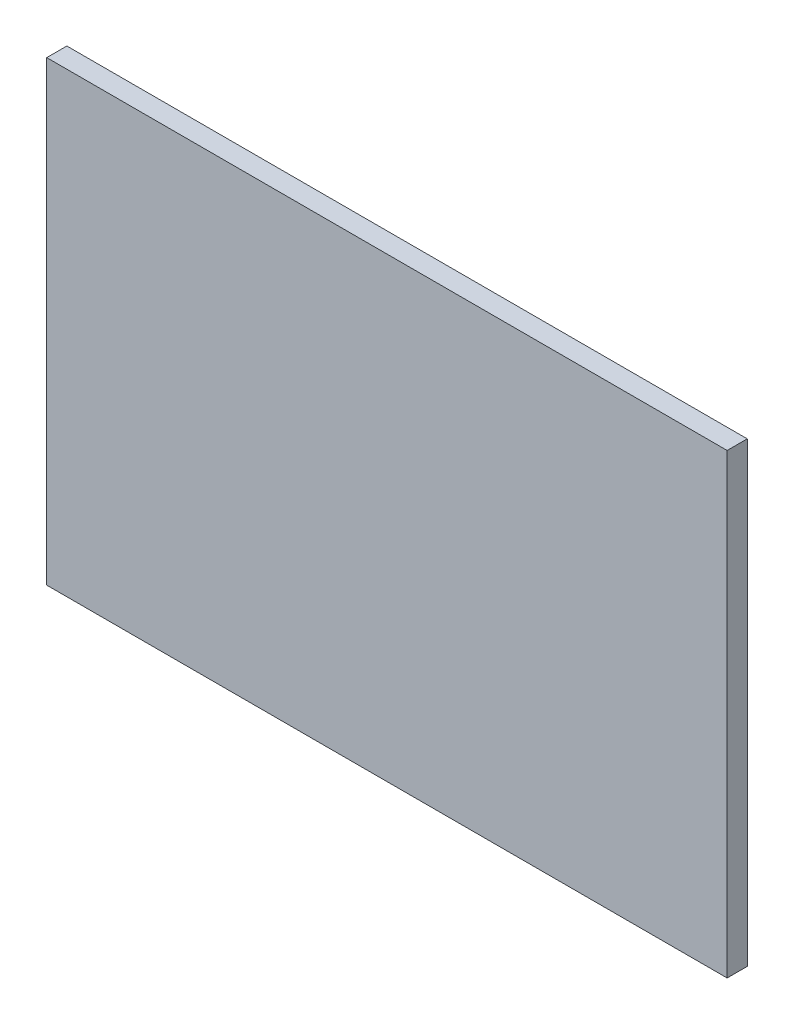
ISO-10303-21;
HEADER;
FILE_DESCRIPTION(('STEP AP214'),'2;1');
FILE_NAME('part.step','',(''),(''),'','','');
FILE_SCHEMA(('AUTOMOTIVE_DESIGN { 1 0 10303 214 1 1 1 1 }'));
ENDSEC;
DATA;
#1=APPLICATION_CONTEXT('core data for automotive mechanical design processes');
#2=APPLICATION_PROTOCOL_DEFINITION('international standard','automotive_design',2000,#1);
#3=PRODUCT_CONTEXT('',#1,'mechanical');
#4=PRODUCT('Part','Part','',(#3));
#5=PRODUCT_RELATED_PRODUCT_CATEGORY('part','',(#4));
#6=PRODUCT_DEFINITION_FORMATION('','',#4);
#7=PRODUCT_DEFINITION_CONTEXT('part definition',#1,'design');
#8=PRODUCT_DEFINITION('design','',#6,#7);
#9=PRODUCT_DEFINITION_SHAPE('','',#8);
#10=(LENGTH_UNIT() NAMED_UNIT(*) SI_UNIT(.MILLI.,.METRE.));
#11=(NAMED_UNIT(*) PLANE_ANGLE_UNIT() SI_UNIT($,.RADIAN.));
#12=(NAMED_UNIT(*) SI_UNIT($,.STERADIAN.) SOLID_ANGLE_UNIT());
#13=UNCERTAINTY_MEASURE_WITH_UNIT(LENGTH_MEASURE(1.E-05),#10,'distance_accuracy_value','');
#14=(GEOMETRIC_REPRESENTATION_CONTEXT(3) GLOBAL_UNCERTAINTY_ASSIGNED_CONTEXT((#13)) GLOBAL_UNIT_ASSIGNED_CONTEXT((#10,
#11,#12)) REPRESENTATION_CONTEXT('',''));
#15=CARTESIAN_POINT('',(0.,0.,0.));
#16=DIRECTION('',(0.,0.,1.));
#17=DIRECTION('',(1.,0.,0.));
#18=AXIS2_PLACEMENT_3D('',#15,#16,#17);
#19=CARTESIAN_POINT('',(1747.57281553398,1339.80582524272,-70.));
#20=DIRECTION('',(0.,1.,0.));
#21=DIRECTION('',(0.,0.,1.));
#22=AXIS2_PLACEMENT_3D('',#19,#20,#21);
#23=PLANE('',#22);
#24=DIRECTION('',(-1.,0.,0.));
#25=VECTOR('',#24,1.);
#26=CARTESIAN_POINT('',(1747.57281553398,1339.80582524272,-70.));
#27=LINE('',#26,#25);
#28=CARTESIAN_POINT('',(-652.427184466019,1339.80582524272,-70.));
#29=VERTEX_POINT('',#28);
#30=CARTESIAN_POINT('',(-1252.42718446602,1339.80582524272,-70.));
#31=VERTEX_POINT('',#30);
#32=EDGE_CURVE('E211',#29,#31,#27,.T.);
#33=ORIENTED_EDGE('',*,*,#32,.F.);
#34=DIRECTION('',(0.,0.,1.));
#35=VECTOR('',#34,1.);
#36=CARTESIAN_POINT('',(-652.427184466019,1339.80582524272,-55.));
#37=LINE('',#36,#35);
#38=CARTESIAN_POINT('',(-652.427184466019,1339.80582524272,0.));
#39=VERTEX_POINT('',#38);
#40=EDGE_CURVE('E62',#29,#39,#37,.T.);
#41=ORIENTED_EDGE('',*,*,#40,.T.);
#42=DIRECTION('',(-1.,0.,0.));
#43=VECTOR('',#42,1.);
#44=CARTESIAN_POINT('',(-1252.42718446602,1339.80582524272,0.));
#45=LINE('',#44,#43);
#46=CARTESIAN_POINT('',(-1252.42718446602,1339.80582524272,0.));
#47=VERTEX_POINT('',#46);
#48=EDGE_CURVE('E47',#39,#47,#45,.T.);
#49=ORIENTED_EDGE('',*,*,#48,.T.);
#50=DIRECTION('',(0.,0.,1.));
#51=VECTOR('',#50,1.);
#52=CARTESIAN_POINT('',(-1252.42718446602,1339.80582524272,-70.));
#53=LINE('',#52,#51);
#54=EDGE_CURVE('E224',#31,#47,#53,.T.);
#55=ORIENTED_EDGE('',*,*,#54,.F.);
#56=EDGE_LOOP('',(#33,#41,#49,#55));
#57=FACE_BOUND('',#56,.T.);
#58=ADVANCED_FACE('F39',(#57),#23,.F.);
#59=DIRECTION('',(0.,0.,1.));
#60=VECTOR('',#59,1.);
#61=CARTESIAN_POINT('',(-637.427184466019,1339.80582524272,-70.));
#62=LINE('',#61,#60);
#63=CARTESIAN_POINT('',(-637.427184466019,1339.80582524272,-70.));
#64=VERTEX_POINT('',#63);
#65=CARTESIAN_POINT('',(-637.427184466018,1339.80582524272,-55.));
#66=VERTEX_POINT('',#65);
#67=EDGE_CURVE('E291',#64,#66,#62,.T.);
#68=ORIENTED_EDGE('',*,*,#67,.F.);
#69=CARTESIAN_POINT('',(1132.57281553398,1339.80582524272,-70.));
#70=VERTEX_POINT('',#69);
#71=EDGE_CURVE('E216',#70,#64,#27,.T.);
#72=ORIENTED_EDGE('',*,*,#71,.F.);
#73=DIRECTION('',(0.,0.,1.));
#74=VECTOR('',#73,1.);
#75=CARTESIAN_POINT('',(1132.57281553398,1339.80582524272,-70.));
#76=LINE('',#75,#74);
#77=CARTESIAN_POINT('',(1132.57281553398,1339.80582524272,-55.));
#78=VERTEX_POINT('',#77);
#79=EDGE_CURVE('E189',#70,#78,#76,.T.);
#80=ORIENTED_EDGE('',*,*,#79,.T.);
#81=DIRECTION('',(1.,0.,0.));
#82=VECTOR('',#81,1.);
#83=CARTESIAN_POINT('',(1147.57281553398,1339.80582524272,-55.));
#84=LINE('',#83,#82);
#85=EDGE_CURVE('E199',#66,#78,#84,.T.);
#86=ORIENTED_EDGE('',*,*,#85,.F.);
#87=EDGE_LOOP('',(#68,#72,#80,#86));
#88=FACE_BOUND('',#87,.T.);
#89=ADVANCED_FACE('F301',(#88),#23,.F.);
#90=CARTESIAN_POINT('',(0.,0.,-55.));
#91=DIRECTION('',(0.,0.,-1.));
#92=DIRECTION('',(-1.,0.,0.));
#93=AXIS2_PLACEMENT_3D('',#90,#91,#92);
#94=PLANE('',#93);
#95=DIRECTION('',(-1.,0.,0.));
#96=VECTOR('',#95,1.);
#97=CARTESIAN_POINT('',(1147.57281553398,889.805825242719,-55.));
#98=LINE('',#97,#96);
#99=CARTESIAN_POINT('',(1132.57281553398,889.805825242719,-55.));
#100=VERTEX_POINT('',#99);
#101=CARTESIAN_POINT('',(-637.427184466019,889.805825242719,-55.));
#102=VERTEX_POINT('',#101);
#103=EDGE_CURVE('E197',#100,#102,#98,.T.);
#104=ORIENTED_EDGE('',*,*,#103,.T.);
#105=DIRECTION('',(0.,-1.,0.));
#106=VECTOR('',#105,1.);
#107=CARTESIAN_POINT('',(-637.427184466019,889.805825242719,-55.));
#108=LINE('',#107,#106);
#109=EDGE_CURVE('E54',#66,#102,#108,.T.);
#110=ORIENTED_EDGE('',*,*,#109,.F.);
#111=ORIENTED_EDGE('',*,*,#85,.T.);
#112=DIRECTION('',(0.,1.,0.));
#113=VECTOR('',#112,1.);
#114=CARTESIAN_POINT('',(1132.57281553398,1339.80582524272,-55.));
#115=LINE('',#114,#113);
#116=EDGE_CURVE('E178',#100,#78,#115,.T.);
#117=ORIENTED_EDGE('',*,*,#116,.F.);
#118=EDGE_LOOP('',(#104,#110,#111,#117));
#119=FACE_BOUND('',#118,.T.);
#120=ADVANCED_FACE('F298',(#119),#94,.T.);
#121=DIRECTION('',(0.,0.,1.));
#122=VECTOR('',#121,1.);
#123=CARTESIAN_POINT('',(1147.57281553398,1339.80582524272,-55.));
#124=LINE('',#123,#122);
#125=CARTESIAN_POINT('',(1147.57281553398,1339.80582524272,-70.));
#126=VERTEX_POINT('',#125);
#127=CARTESIAN_POINT('',(1147.57281553398,1339.80582524272,0.));
#128=VERTEX_POINT('',#127);
#129=EDGE_CURVE('E202',#126,#128,#124,.T.);
#130=ORIENTED_EDGE('',*,*,#129,.F.);
#131=CARTESIAN_POINT('',(1747.57281553398,1339.80582524272,-70.));
#132=VERTEX_POINT('',#131);
#133=EDGE_CURVE('E212',#132,#126,#27,.T.);
#134=ORIENTED_EDGE('',*,*,#133,.F.);
#135=DIRECTION('',(0.,0.,1.));
#136=VECTOR('',#135,1.);
#137=CARTESIAN_POINT('',(1747.57281553398,1339.80582524272,-70.));
#138=LINE('',#137,#136);
#139=CARTESIAN_POINT('',(1747.57281553398,1339.80582524272,0.));
#140=VERTEX_POINT('',#139);
#141=EDGE_CURVE('E225',#132,#140,#138,.T.);
#142=ORIENTED_EDGE('',*,*,#141,.T.);
#143=EDGE_CURVE('E11',#140,#128,#45,.T.);
#144=ORIENTED_EDGE('',*,*,#143,.T.);
#145=EDGE_LOOP('',(#130,#134,#142,#144));
#146=FACE_BOUND('',#145,.T.);
#147=ADVANCED_FACE('F304',(#146),#23,.F.);
#148=CARTESIAN_POINT('',(0.,0.,0.));
#149=DIRECTION('',(0.,0.,1.));
#150=DIRECTION('',(1.,0.,0.));
#151=AXIS2_PLACEMENT_3D('',#148,#149,#150);
#152=PLANE('',#151);
#153=DIRECTION('',(0.,-1.,0.));
#154=VECTOR('',#153,1.);
#155=CARTESIAN_POINT('',(1147.57281553398,1339.80582524272,0.));
#156=LINE('',#155,#154);
#157=CARTESIAN_POINT('',(1147.57281553398,889.805825242719,0.));
#158=VERTEX_POINT('',#157);
#159=EDGE_CURVE('E196',#128,#158,#156,.T.);
#160=ORIENTED_EDGE('',*,*,#159,.F.);
#161=ORIENTED_EDGE('',*,*,#143,.F.);
#162=DIRECTION('',(0.,1.,0.));
#163=VECTOR('',#162,1.);
#164=CARTESIAN_POINT('',(1747.57281553398,1339.80582524272,0.));
#165=LINE('',#164,#163);
#166=CARTESIAN_POINT('',(1747.57281553398,-660.194174757282,0.));
#167=VERTEX_POINT('',#166);
#168=EDGE_CURVE('E273',#167,#140,#165,.T.);
#169=ORIENTED_EDGE('',*,*,#168,.F.);
#170=DIRECTION('',(1.,0.,0.));
#171=VECTOR('',#170,1.);
#172=CARTESIAN_POINT('',(-1252.42718446602,-660.194174757282,0.));
#173=LINE('',#172,#171);
#174=CARTESIAN_POINT('',(-1252.42718446602,-660.194174757282,0.));
#175=VERTEX_POINT('',#174);
#176=EDGE_CURVE('E271',#175,#167,#173,.T.);
#177=ORIENTED_EDGE('',*,*,#176,.F.);
#178=DIRECTION('',(0.,-1.,0.));
#179=VECTOR('',#178,1.);
#180=CARTESIAN_POINT('',(-1252.42718446602,1339.80582524272,0.));
#181=LINE('',#180,#179);
#182=EDGE_CURVE('E263',#47,#175,#181,.T.);
#183=ORIENTED_EDGE('',*,*,#182,.F.);
#184=ORIENTED_EDGE('',*,*,#48,.F.);
#185=DIRECTION('',(0.,1.,0.));
#186=VECTOR('',#185,1.);
#187=CARTESIAN_POINT('',(-652.427184466019,1339.80582524272,0.));
#188=LINE('',#187,#186);
#189=CARTESIAN_POINT('',(-652.427184466019,889.805825242719,0.));
#190=VERTEX_POINT('',#189);
#191=EDGE_CURVE('E200',#190,#39,#188,.T.);
#192=ORIENTED_EDGE('',*,*,#191,.F.);
#193=DIRECTION('',(-1.,0.,0.));
#194=VECTOR('',#193,1.);
#195=CARTESIAN_POINT('',(1147.57281553398,889.805825242719,0.));
#196=LINE('',#195,#194);
#197=EDGE_CURVE('E161',#158,#190,#196,.T.);
#198=ORIENTED_EDGE('',*,*,#197,.F.);
#199=EDGE_LOOP('',(#160,#161,#169,#177,#183,#184,#192,#198));
#200=FACE_BOUND('',#199,.T.);
#201=ADVANCED_FACE('F41',(#200),#152,.F.);
#202=CARTESIAN_POINT('',(0.,0.,20.));
#203=DIRECTION('',(0.,0.,1.));
#204=DIRECTION('',(1.,0.,0.));
#205=AXIS2_PLACEMENT_3D('',#202,#203,#204);
#206=PLANE('',#205);
#207=DIRECTION('',(-1.,0.,0.));
#208=VECTOR('',#207,1.);
#209=CARTESIAN_POINT('',(1769.57281553398,1361.80582524272,20.));
#210=LINE('',#209,#208);
#211=CARTESIAN_POINT('',(1769.57281553398,1361.80582524272,20.));
#212=VERTEX_POINT('',#211);
#213=CARTESIAN_POINT('',(-1274.42718446602,1361.80582524272,20.));
#214=VERTEX_POINT('',#213);
#215=EDGE_CURVE('E228',#212,#214,#210,.T.);
#216=ORIENTED_EDGE('',*,*,#215,.T.);
#217=DIRECTION('',(0.,-1.,0.));
#218=VECTOR('',#217,1.);
#219=CARTESIAN_POINT('',(-1274.42718446602,1361.80582524272,20.));
#220=LINE('',#219,#218);
#221=CARTESIAN_POINT('',(-1274.42718446602,-682.194174757282,20.));
#222=VERTEX_POINT('',#221);
#223=EDGE_CURVE('E253',#214,#222,#220,.T.);
#224=ORIENTED_EDGE('',*,*,#223,.T.);
#225=DIRECTION('',(1.,0.,0.));
#226=VECTOR('',#225,1.);
#227=CARTESIAN_POINT('',(-1274.42718446602,-682.194174757282,20.));
#228=LINE('',#227,#226);
#229=CARTESIAN_POINT('',(1769.57281553398,-682.194174757282,20.));
#230=VERTEX_POINT('',#229);
#231=EDGE_CURVE('E256',#222,#230,#228,.T.);
#232=ORIENTED_EDGE('',*,*,#231,.T.);
#233=DIRECTION('',(0.,1.,0.));
#234=VECTOR('',#233,1.);
#235=CARTESIAN_POINT('',(1769.57281553398,-682.194174757282,20.));
#236=LINE('',#235,#234);
#237=EDGE_CURVE('E241',#230,#212,#236,.T.);
#238=ORIENTED_EDGE('',*,*,#237,.T.);
#239=EDGE_LOOP('',(#216,#224,#232,#238));
#240=FACE_BOUND('',#239,.T.);
#241=ADVANCED_FACE('F317',(#240),#206,.T.);
#242=CARTESIAN_POINT('',(1747.57281553398,-660.194174757282,-70.));
#243=DIRECTION('',(1.,0.,0.));
#244=DIRECTION('',(0.,0.,-1.));
#245=AXIS2_PLACEMENT_3D('',#242,#243,#244);
#246=PLANE('',#245);
#247=DIRECTION('',(0.,0.,1.));
#248=VECTOR('',#247,1.);
#249=CARTESIAN_POINT('',(1747.57281553398,-660.194174757282,-70.));
#250=LINE('',#249,#248);
#251=CARTESIAN_POINT('',(1747.57281553398,-660.194174757282,-70.));
#252=VERTEX_POINT('',#251);
#253=EDGE_CURVE('E229',#252,#167,#250,.T.);
#254=ORIENTED_EDGE('',*,*,#253,.T.);
#255=ORIENTED_EDGE('',*,*,#168,.T.);
#256=ORIENTED_EDGE('',*,*,#141,.F.);
#257=DIRECTION('',(0.,1.,0.));
#258=VECTOR('',#257,1.);
#259=CARTESIAN_POINT('',(1747.57281553398,-660.194174757282,-70.));
#260=LINE('',#259,#258);
#261=EDGE_CURVE('E222',#252,#132,#260,.T.);
#262=ORIENTED_EDGE('',*,*,#261,.F.);
#263=EDGE_LOOP('',(#254,#255,#256,#262));
#264=FACE_BOUND('',#263,.T.);
#265=ADVANCED_FACE('F323',(#264),#246,.F.);
#266=CARTESIAN_POINT('',(-1252.42718446602,-660.194174757282,-70.));
#267=DIRECTION('',(0.,-1.,0.));
#268=DIRECTION('',(0.,0.,-1.));
#269=AXIS2_PLACEMENT_3D('',#266,#267,#268);
#270=PLANE('',#269);
#271=DIRECTION('',(0.,0.,1.));
#272=VECTOR('',#271,1.);
#273=CARTESIAN_POINT('',(-1252.42718446602,-660.194174757282,-70.));
#274=LINE('',#273,#272);
#275=CARTESIAN_POINT('',(-1252.42718446602,-660.194174757282,-70.));
#276=VERTEX_POINT('',#275);
#277=EDGE_CURVE('E232',#276,#175,#274,.T.);
#278=ORIENTED_EDGE('',*,*,#277,.T.);
#279=ORIENTED_EDGE('',*,*,#176,.T.);
#280=ORIENTED_EDGE('',*,*,#253,.F.);
#281=DIRECTION('',(1.,0.,0.));
#282=VECTOR('',#281,1.);
#283=CARTESIAN_POINT('',(-1252.42718446602,-660.194174757282,-70.));
#284=LINE('',#283,#282);
#285=EDGE_CURVE('E219',#276,#252,#284,.T.);
#286=ORIENTED_EDGE('',*,*,#285,.F.);
#287=EDGE_LOOP('',(#278,#279,#280,#286));
#288=FACE_BOUND('',#287,.T.);
#289=ADVANCED_FACE('F325',(#288),#270,.F.);
#290=CARTESIAN_POINT('',(-1252.42718446602,1339.80582524272,-70.));
#291=DIRECTION('',(-1.,0.,0.));
#292=DIRECTION('',(0.,0.,1.));
#293=AXIS2_PLACEMENT_3D('',#290,#291,#292);
#294=PLANE('',#293);
#295=ORIENTED_EDGE('',*,*,#54,.T.);
#296=ORIENTED_EDGE('',*,*,#182,.T.);
#297=ORIENTED_EDGE('',*,*,#277,.F.);
#298=DIRECTION('',(0.,-1.,0.));
#299=VECTOR('',#298,1.);
#300=CARTESIAN_POINT('',(-1252.42718446602,1339.80582524272,-70.));
#301=LINE('',#300,#299);
#302=EDGE_CURVE('E215',#31,#276,#301,.T.);
#303=ORIENTED_EDGE('',*,*,#302,.F.);
#304=EDGE_LOOP('',(#295,#296,#297,#303));
#305=FACE_BOUND('',#304,.T.);
#306=ADVANCED_FACE('F283',(#305),#294,.F.);
#307=CARTESIAN_POINT('',(1769.57281553398,1361.80582524272,-70.));
#308=DIRECTION('',(0.,1.,0.));
#309=DIRECTION('',(0.,0.,1.));
#310=AXIS2_PLACEMENT_3D('',#307,#308,#309);
#311=PLANE('',#310);
#312=ORIENTED_EDGE('',*,*,#215,.F.);
#313=DIRECTION('',(0.,0.,1.));
#314=VECTOR('',#313,1.);
#315=CARTESIAN_POINT('',(1769.57281553398,1361.80582524272,-70.));
#316=LINE('',#315,#314);
#317=CARTESIAN_POINT('',(1769.57281553398,1361.80582524272,-70.));
#318=VERTEX_POINT('',#317);
#319=EDGE_CURVE('E261',#318,#212,#316,.T.);
#320=ORIENTED_EDGE('',*,*,#319,.F.);
#321=DIRECTION('',(-1.,0.,0.));
#322=VECTOR('',#321,1.);
#323=CARTESIAN_POINT('',(1769.57281553398,1361.80582524272,-70.));
#324=LINE('',#323,#322);
#325=CARTESIAN_POINT('',(-1274.42718446602,1361.80582524272,-70.));
#326=VERTEX_POINT('',#325);
#327=EDGE_CURVE('E237',#318,#326,#324,.T.);
#328=ORIENTED_EDGE('',*,*,#327,.T.);
#329=DIRECTION('',(0.,0.,1.));
#330=VECTOR('',#329,1.);
#331=CARTESIAN_POINT('',(-1274.42718446602,1361.80582524272,-70.));
#332=LINE('',#331,#330);
#333=EDGE_CURVE('E250',#326,#214,#332,.T.);
#334=ORIENTED_EDGE('',*,*,#333,.T.);
#335=EDGE_LOOP('',(#312,#320,#328,#334));
#336=FACE_BOUND('',#335,.T.);
#337=ADVANCED_FACE('F332',(#336),#311,.T.);
#338=CARTESIAN_POINT('',(1769.57281553398,-682.194174757282,-70.));
#339=DIRECTION('',(1.,0.,0.));
#340=DIRECTION('',(0.,1.,0.));
#341=AXIS2_PLACEMENT_3D('',#338,#339,#340);
#342=PLANE('',#341);
#343=ORIENTED_EDGE('',*,*,#237,.F.);
#344=DIRECTION('',(0.,0.,1.));
#345=VECTOR('',#344,1.);
#346=CARTESIAN_POINT('',(1769.57281553398,-682.194174757282,-70.));
#347=LINE('',#346,#345);
#348=CARTESIAN_POINT('',(1769.57281553398,-682.194174757282,-70.));
#349=VERTEX_POINT('',#348);
#350=EDGE_CURVE('E264',#349,#230,#347,.T.);
#351=ORIENTED_EDGE('',*,*,#350,.F.);
#352=DIRECTION('',(0.,1.,0.));
#353=VECTOR('',#352,1.);
#354=CARTESIAN_POINT('',(1769.57281553398,-682.194174757282,-70.));
#355=LINE('',#354,#353);
#356=EDGE_CURVE('E247',#349,#318,#355,.T.);
#357=ORIENTED_EDGE('',*,*,#356,.T.);
#358=ORIENTED_EDGE('',*,*,#319,.T.);
#359=EDGE_LOOP('',(#343,#351,#357,#358));
#360=FACE_BOUND('',#359,.T.);
#361=ADVANCED_FACE('F386',(#360),#342,.T.);
#362=CARTESIAN_POINT('',(-1274.42718446602,-682.194174757282,-70.));
#363=DIRECTION('',(0.,-1.,0.));
#364=DIRECTION('',(0.,0.,-1.));
#365=AXIS2_PLACEMENT_3D('',#362,#363,#364);
#366=PLANE('',#365);
#367=ORIENTED_EDGE('',*,*,#231,.F.);
#368=DIRECTION('',(0.,0.,1.));
#369=VECTOR('',#368,1.);
#370=CARTESIAN_POINT('',(-1274.42718446602,-682.194174757282,-70.));
#371=LINE('',#370,#369);
#372=CARTESIAN_POINT('',(-1274.42718446602,-682.194174757282,-70.));
#373=VERTEX_POINT('',#372);
#374=EDGE_CURVE('E266',#373,#222,#371,.T.);
#375=ORIENTED_EDGE('',*,*,#374,.F.);
#376=DIRECTION('',(1.,0.,0.));
#377=VECTOR('',#376,1.);
#378=CARTESIAN_POINT('',(-1274.42718446602,-682.194174757282,-70.));
#379=LINE('',#378,#377);
#380=EDGE_CURVE('E244',#373,#349,#379,.T.);
#381=ORIENTED_EDGE('',*,*,#380,.T.);
#382=ORIENTED_EDGE('',*,*,#350,.T.);
#383=EDGE_LOOP('',(#367,#375,#381,#382));
#384=FACE_BOUND('',#383,.T.);
#385=ADVANCED_FACE('F376',(#384),#366,.T.);
#386=CARTESIAN_POINT('',(-1274.42718446602,1361.80582524272,-70.));
#387=DIRECTION('',(-1.,0.,0.));
#388=DIRECTION('',(0.,-1.,0.));
#389=AXIS2_PLACEMENT_3D('',#386,#387,#388);
#390=PLANE('',#389);
#391=ORIENTED_EDGE('',*,*,#223,.F.);
#392=ORIENTED_EDGE('',*,*,#333,.F.);
#393=DIRECTION('',(0.,-1.,0.));
#394=VECTOR('',#393,1.);
#395=CARTESIAN_POINT('',(-1274.42718446602,1361.80582524272,-70.));
#396=LINE('',#395,#394);
#397=EDGE_CURVE('E240',#326,#373,#396,.T.);
#398=ORIENTED_EDGE('',*,*,#397,.T.);
#399=ORIENTED_EDGE('',*,*,#374,.T.);
#400=EDGE_LOOP('',(#391,#392,#398,#399));
#401=FACE_BOUND('',#400,.T.);
#402=ADVANCED_FACE('F370',(#401),#390,.T.);
#403=CARTESIAN_POINT('',(0.,0.,-70.));
#404=DIRECTION('',(0.,0.,1.));
#405=DIRECTION('',(1.,0.,0.));
#406=AXIS2_PLACEMENT_3D('',#403,#404,#405);
#407=PLANE('',#406);
#408=ORIENTED_EDGE('',*,*,#261,.T.);
#409=ORIENTED_EDGE('',*,*,#133,.T.);
#410=DIRECTION('',(0.,-1.,0.));
#411=VECTOR('',#410,1.);
#412=CARTESIAN_POINT('',(1147.57281553398,1339.80582524272,-70.));
#413=LINE('',#412,#411);
#414=CARTESIAN_POINT('',(1147.57281553398,889.805825242719,-70.));
#415=VERTEX_POINT('',#414);
#416=EDGE_CURVE('E182',#126,#415,#413,.T.);
#417=ORIENTED_EDGE('',*,*,#416,.T.);
#418=DIRECTION('',(-1.,0.,0.));
#419=VECTOR('',#418,1.);
#420=CARTESIAN_POINT('',(1147.57281553398,889.805825242719,-70.));
#421=LINE('',#420,#419);
#422=CARTESIAN_POINT('',(1132.57281553398,889.805825242719,-70.));
#423=VERTEX_POINT('',#422);
#424=EDGE_CURVE('E185',#415,#423,#421,.T.);
#425=ORIENTED_EDGE('',*,*,#424,.T.);
#426=DIRECTION('',(0.,1.,0.));
#427=VECTOR('',#426,1.);
#428=CARTESIAN_POINT('',(1132.57281553398,1339.80582524272,-70.));
#429=LINE('',#428,#427);
#430=EDGE_CURVE('E187',#423,#70,#429,.T.);
#431=ORIENTED_EDGE('',*,*,#430,.T.);
#432=ORIENTED_EDGE('',*,*,#71,.T.);
#433=DIRECTION('',(0.,-1.,0.));
#434=VECTOR('',#433,1.);
#435=CARTESIAN_POINT('',(-637.427184466019,889.805825242719,-70.));
#436=LINE('',#435,#434);
#437=CARTESIAN_POINT('',(-637.427184466019,889.805825242719,-70.));
#438=VERTEX_POINT('',#437);
#439=EDGE_CURVE('E172',#64,#438,#436,.T.);
#440=ORIENTED_EDGE('',*,*,#439,.T.);
#441=DIRECTION('',(-1.,0.,0.));
#442=VECTOR('',#441,1.);
#443=CARTESIAN_POINT('',(-652.427184466019,889.805825242719,-70.));
#444=LINE('',#443,#442);
#445=CARTESIAN_POINT('',(-652.427184466019,889.805825242719,-70.));
#446=VERTEX_POINT('',#445);
#447=EDGE_CURVE('E159',#438,#446,#444,.T.);
#448=ORIENTED_EDGE('',*,*,#447,.T.);
#449=DIRECTION('',(0.,1.,0.));
#450=VECTOR('',#449,1.);
#451=CARTESIAN_POINT('',(-652.427184466019,889.805825242719,-70.));
#452=LINE('',#451,#450);
#453=EDGE_CURVE('E169',#446,#29,#452,.T.);
#454=ORIENTED_EDGE('',*,*,#453,.T.);
#455=ORIENTED_EDGE('',*,*,#32,.T.);
#456=ORIENTED_EDGE('',*,*,#302,.T.);
#457=ORIENTED_EDGE('',*,*,#285,.T.);
#458=EDGE_LOOP('',(#408,#409,#417,#425,#431,#432,#440,#448,#454,#455,#456,#457));
#459=FACE_BOUND('',#458,.T.);
#460=ORIENTED_EDGE('',*,*,#327,.F.);
#461=ORIENTED_EDGE('',*,*,#356,.F.);
#462=ORIENTED_EDGE('',*,*,#380,.F.);
#463=ORIENTED_EDGE('',*,*,#397,.F.);
#464=EDGE_LOOP('',(#460,#461,#462,#463));
#465=FACE_BOUND('',#464,.T.);
#466=ADVANCED_FACE('F167',(#459,#465),#407,.F.);
#467=CARTESIAN_POINT('',(1147.57281553398,1339.80582524272,-55.));
#468=DIRECTION('',(-1.,0.,0.));
#469=DIRECTION('',(0.,0.,1.));
#470=AXIS2_PLACEMENT_3D('',#467,#468,#469);
#471=PLANE('',#470);
#472=ORIENTED_EDGE('',*,*,#159,.T.);
#473=DIRECTION('',(0.,0.,1.));
#474=VECTOR('',#473,1.);
#475=CARTESIAN_POINT('',(1147.57281553398,889.805825242719,-55.));
#476=LINE('',#475,#474);
#477=EDGE_CURVE('E162',#415,#158,#476,.T.);
#478=ORIENTED_EDGE('',*,*,#477,.F.);
#479=ORIENTED_EDGE('',*,*,#416,.F.);
#480=ORIENTED_EDGE('',*,*,#129,.T.);
#481=EDGE_LOOP('',(#472,#478,#479,#480));
#482=FACE_BOUND('',#481,.T.);
#483=ADVANCED_FACE('F321',(#482),#471,.F.);
#484=CARTESIAN_POINT('',(1147.57281553398,889.805825242719,-55.));
#485=DIRECTION('',(0.,1.,0.));
#486=DIRECTION('',(0.,0.,1.));
#487=AXIS2_PLACEMENT_3D('',#484,#485,#486);
#488=PLANE('',#487);
#489=ORIENTED_EDGE('',*,*,#197,.T.);
#490=DIRECTION('',(0.,0.,1.));
#491=VECTOR('',#490,1.);
#492=CARTESIAN_POINT('',(-652.427184466019,889.805825242719,-55.));
#493=LINE('',#492,#491);
#494=EDGE_CURVE('E155',#446,#190,#493,.T.);
#495=ORIENTED_EDGE('',*,*,#494,.F.);
#496=ORIENTED_EDGE('',*,*,#447,.F.);
#497=DIRECTION('',(0.,0.,1.));
#498=VECTOR('',#497,1.);
#499=CARTESIAN_POINT('',(-637.427184466019,889.805825242719,-70.));
#500=LINE('',#499,#498);
#501=EDGE_CURVE('E174',#438,#102,#500,.T.);
#502=ORIENTED_EDGE('',*,*,#501,.T.);
#503=ORIENTED_EDGE('',*,*,#103,.F.);
#504=DIRECTION('',(0.,0.,1.));
#505=VECTOR('',#504,1.);
#506=CARTESIAN_POINT('',(1132.57281553398,889.805825242719,-70.));
#507=LINE('',#506,#505);
#508=EDGE_CURVE('E194',#423,#100,#507,.T.);
#509=ORIENTED_EDGE('',*,*,#508,.F.);
#510=ORIENTED_EDGE('',*,*,#424,.F.);
#511=ORIENTED_EDGE('',*,*,#477,.T.);
#512=EDGE_LOOP('',(#489,#495,#496,#502,#503,#509,#510,#511));
#513=FACE_BOUND('',#512,.T.);
#514=ADVANCED_FACE('F157',(#513),#488,.F.);
#515=CARTESIAN_POINT('',(-652.427184466019,1339.80582524272,-55.));
#516=DIRECTION('',(1.,0.,0.));
#517=DIRECTION('',(0.,1.,0.));
#518=AXIS2_PLACEMENT_3D('',#515,#516,#517);
#519=PLANE('',#518);
#520=ORIENTED_EDGE('',*,*,#191,.T.);
#521=ORIENTED_EDGE('',*,*,#40,.F.);
#522=ORIENTED_EDGE('',*,*,#453,.F.);
#523=ORIENTED_EDGE('',*,*,#494,.T.);
#524=EDGE_LOOP('',(#520,#521,#522,#523));
#525=FACE_BOUND('',#524,.T.);
#526=ADVANCED_FACE('F176',(#525),#519,.F.);
#527=CARTESIAN_POINT('',(1132.57281553398,1339.80582524272,-70.));
#528=DIRECTION('',(1.,0.,0.));
#529=DIRECTION('',(0.,1.,0.));
#530=AXIS2_PLACEMENT_3D('',#527,#528,#529);
#531=PLANE('',#530);
#532=ORIENTED_EDGE('',*,*,#116,.T.);
#533=ORIENTED_EDGE('',*,*,#79,.F.);
#534=ORIENTED_EDGE('',*,*,#430,.F.);
#535=ORIENTED_EDGE('',*,*,#508,.T.);
#536=EDGE_LOOP('',(#532,#533,#534,#535));
#537=FACE_BOUND('',#536,.T.);
#538=ADVANCED_FACE('F300',(#537),#531,.F.);
#539=CARTESIAN_POINT('',(-637.427184466019,889.805825242719,-70.));
#540=DIRECTION('',(-1.,0.,0.));
#541=DIRECTION('',(0.,0.,1.));
#542=AXIS2_PLACEMENT_3D('',#539,#540,#541);
#543=PLANE('',#542);
#544=ORIENTED_EDGE('',*,*,#109,.T.);
#545=ORIENTED_EDGE('',*,*,#501,.F.);
#546=ORIENTED_EDGE('',*,*,#439,.F.);
#547=ORIENTED_EDGE('',*,*,#67,.T.);
#548=EDGE_LOOP('',(#544,#545,#546,#547));
#549=FACE_BOUND('',#548,.T.);
#550=ADVANCED_FACE('F290',(#549),#543,.F.);
#551=CLOSED_SHELL('',(#58,#89,#120,#147,#201,#241,#265,#289,#306,#337,#361,#385,#402,#466,#483,
#514,#526,#538,#550));
#552=MANIFOLD_SOLID_BREP('B2',#551);
#553=ADVANCED_BREP_SHAPE_REPRESENTATION('',(#18,#552),#14);
#554=SHAPE_DEFINITION_REPRESENTATION(#9,#553);
ENDSEC;
END-ISO-10303-21;
